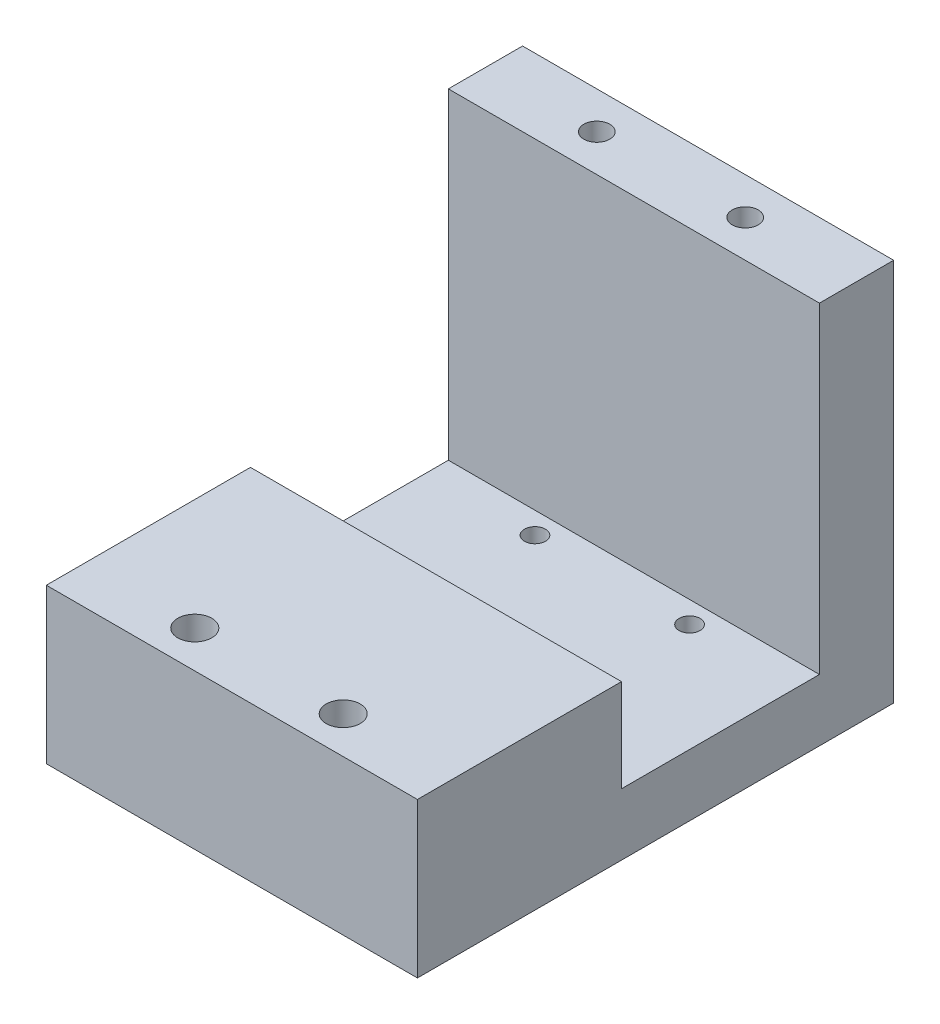
ISO-10303-21;
HEADER;
FILE_DESCRIPTION(('STEP AP214'),'2;1');
FILE_NAME('part.step','',(''),(''),'','','');
FILE_SCHEMA(('AUTOMOTIVE_DESIGN { 1 0 10303 214 1 1 1 1 }'));
ENDSEC;
DATA;
#1=APPLICATION_CONTEXT('core data for automotive mechanical design processes');
#2=APPLICATION_PROTOCOL_DEFINITION('international standard','automotive_design',2000,#1);
#3=PRODUCT_CONTEXT('',#1,'mechanical');
#4=PRODUCT('Part','Part','',(#3));
#5=PRODUCT_RELATED_PRODUCT_CATEGORY('part','',(#4));
#6=PRODUCT_DEFINITION_FORMATION('','',#4);
#7=PRODUCT_DEFINITION_CONTEXT('part definition',#1,'design');
#8=PRODUCT_DEFINITION('design','',#6,#7);
#9=PRODUCT_DEFINITION_SHAPE('','',#8);
#10=(LENGTH_UNIT() NAMED_UNIT(*) SI_UNIT(.MILLI.,.METRE.));
#11=(NAMED_UNIT(*) PLANE_ANGLE_UNIT() SI_UNIT($,.RADIAN.));
#12=(NAMED_UNIT(*) SI_UNIT($,.STERADIAN.) SOLID_ANGLE_UNIT());
#13=UNCERTAINTY_MEASURE_WITH_UNIT(LENGTH_MEASURE(1.E-05),#10,'distance_accuracy_value','');
#14=(GEOMETRIC_REPRESENTATION_CONTEXT(3) GLOBAL_UNCERTAINTY_ASSIGNED_CONTEXT((#13)) GLOBAL_UNIT_ASSIGNED_CONTEXT((#10,
#11,#12)) REPRESENTATION_CONTEXT('',''));
#15=CARTESIAN_POINT('',(0.,0.,0.));
#16=DIRECTION('',(0.,0.,1.));
#17=DIRECTION('',(1.,0.,0.));
#18=AXIS2_PLACEMENT_3D('',#15,#16,#17);
#19=CARTESIAN_POINT('',(0.,10.,0.));
#20=DIRECTION('',(0.,-1.,0.));
#21=DIRECTION('',(0.,0.,-1.));
#22=AXIS2_PLACEMENT_3D('',#19,#20,#21);
#23=PLANE('',#22);
#24=CARTESIAN_POINT('',(42.5,10.,-61.5000000000001));
#25=DIRECTION('',(0.,-1.,0.));
#26=DIRECTION('',(0.,0.,-1.));
#27=AXIS2_PLACEMENT_3D('',#24,#25,#26);
#28=CIRCLE('',#27,1.69999999999999);
#29=CARTESIAN_POINT('',(42.5,10.,-63.2000000000001));
#30=VERTEX_POINT('',#29);
#31=EDGE_CURVE('E43',#30,#30,#28,.T.);
#32=ORIENTED_EDGE('',*,*,#31,.T.);
#33=EDGE_LOOP('',(#32));
#34=FACE_BOUND('',#33,.T.);
#35=CARTESIAN_POINT('',(17.5,10.,-61.5000000000001));
#36=DIRECTION('',(0.,-1.,0.));
#37=DIRECTION('',(0.,0.,-1.));
#38=AXIS2_PLACEMENT_3D('',#35,#36,#37);
#39=CIRCLE('',#38,1.69999999999999);
#40=CARTESIAN_POINT('',(17.5,10.,-63.2000000000001));
#41=VERTEX_POINT('',#40);
#42=EDGE_CURVE('E192',#41,#41,#39,.T.);
#43=ORIENTED_EDGE('',*,*,#42,.T.);
#44=EDGE_LOOP('',(#43));
#45=FACE_BOUND('',#44,.T.);
#46=CARTESIAN_POINT('',(17.4999999999997,10.,-36.5000000000002));
#47=DIRECTION('',(0.,-1.,0.));
#48=DIRECTION('',(0.,0.,-1.));
#49=AXIS2_PLACEMENT_3D('',#46,#47,#48);
#50=CIRCLE('',#49,1.69999999999999);
#51=CARTESIAN_POINT('',(17.4999999999997,10.,-38.2000000000002));
#52=VERTEX_POINT('',#51);
#53=EDGE_CURVE('E188',#52,#52,#50,.T.);
#54=ORIENTED_EDGE('',*,*,#53,.T.);
#55=EDGE_LOOP('',(#54));
#56=FACE_BOUND('',#55,.T.);
#57=CARTESIAN_POINT('',(42.4999999999997,10.,-36.5000000000002));
#58=DIRECTION('',(0.,-1.,0.));
#59=DIRECTION('',(0.,0.,-1.));
#60=AXIS2_PLACEMENT_3D('',#57,#58,#59);
#61=CIRCLE('',#60,1.69999999999999);
#62=CARTESIAN_POINT('',(42.4999999999997,10.,-38.2000000000002));
#63=VERTEX_POINT('',#62);
#64=EDGE_CURVE('E183',#63,#63,#61,.T.);
#65=ORIENTED_EDGE('',*,*,#64,.T.);
#66=EDGE_LOOP('',(#65));
#67=FACE_BOUND('',#66,.T.);
#68=DIRECTION('',(-1.,0.,0.));
#69=VECTOR('',#68,1.);
#70=CARTESIAN_POINT('',(0.,10.,-33.));
#71=LINE('',#70,#69);
#72=CARTESIAN_POINT('',(60.,10.,-33.));
#73=VERTEX_POINT('',#72);
#74=CARTESIAN_POINT('',(0.,10.,-33.));
#75=VERTEX_POINT('',#74);
#76=EDGE_CURVE('E125',#73,#75,#71,.T.);
#77=ORIENTED_EDGE('',*,*,#76,.F.);
#78=DIRECTION('',(0.,0.,-1.));
#79=VECTOR('',#78,1.);
#80=CARTESIAN_POINT('',(60.,10.,0.));
#81=LINE('',#80,#79);
#82=CARTESIAN_POINT('',(60.,10.,-65.));
#83=VERTEX_POINT('',#82);
#84=EDGE_CURVE('E158',#73,#83,#81,.T.);
#85=ORIENTED_EDGE('',*,*,#84,.T.);
#86=DIRECTION('',(1.,0.,0.));
#87=VECTOR('',#86,1.);
#88=CARTESIAN_POINT('',(0.,10.,-65.));
#89=LINE('',#88,#87);
#90=CARTESIAN_POINT('',(0.,10.,-65.));
#91=VERTEX_POINT('',#90);
#92=EDGE_CURVE('E61',#91,#83,#89,.T.);
#93=ORIENTED_EDGE('',*,*,#92,.F.);
#94=DIRECTION('',(0.,0.,1.));
#95=VECTOR('',#94,1.);
#96=CARTESIAN_POINT('',(0.,10.,0.));
#97=LINE('',#96,#95);
#98=EDGE_CURVE('E56',#91,#75,#97,.T.);
#99=ORIENTED_EDGE('',*,*,#98,.T.);
#100=EDGE_LOOP('',(#77,#85,#93,#99));
#101=FACE_BOUND('',#100,.T.);
#102=ADVANCED_FACE('F39',(#34,#45,#56,#67,#101),#23,.F.);
#103=CARTESIAN_POINT('',(0.,10.,0.));
#104=DIRECTION('',(1.,0.,0.));
#105=DIRECTION('',(0.,0.,-1.));
#106=AXIS2_PLACEMENT_3D('',#103,#104,#105);
#107=PLANE('',#106);
#108=DIRECTION('',(0.,0.,1.));
#109=VECTOR('',#108,1.);
#110=CARTESIAN_POINT('',(0.,0.,0.));
#111=LINE('',#110,#109);
#112=CARTESIAN_POINT('',(0.,0.,-77.));
#113=VERTEX_POINT('',#112);
#114=CARTESIAN_POINT('',(0.,0.,0.));
#115=VERTEX_POINT('',#114);
#116=EDGE_CURVE('E111',#113,#115,#111,.T.);
#117=ORIENTED_EDGE('',*,*,#116,.T.);
#118=DIRECTION('',(0.,-1.,0.));
#119=VECTOR('',#118,1.);
#120=CARTESIAN_POINT('',(0.,10.,0.));
#121=LINE('',#120,#119);
#122=CARTESIAN_POINT('',(0.,25.,0.));
#123=VERTEX_POINT('',#122);
#124=EDGE_CURVE('E11',#123,#115,#121,.T.);
#125=ORIENTED_EDGE('',*,*,#124,.F.);
#126=DIRECTION('',(0.,0.,1.));
#127=VECTOR('',#126,1.);
#128=CARTESIAN_POINT('',(0.,25.,0.));
#129=LINE('',#128,#127);
#130=CARTESIAN_POINT('',(0.,25.,-33.));
#131=VERTEX_POINT('',#130);
#132=EDGE_CURVE('E108',#131,#123,#129,.T.);
#133=ORIENTED_EDGE('',*,*,#132,.F.);
#134=DIRECTION('',(0.,-1.,0.));
#135=VECTOR('',#134,1.);
#136=CARTESIAN_POINT('',(0.,25.,-33.));
#137=LINE('',#136,#135);
#138=EDGE_CURVE('E133',#131,#75,#137,.T.);
#139=ORIENTED_EDGE('',*,*,#138,.T.);
#140=ORIENTED_EDGE('',*,*,#98,.F.);
#141=DIRECTION('',(0.,-1.,0.));
#142=VECTOR('',#141,1.);
#143=CARTESIAN_POINT('',(0.,62.,-65.));
#144=LINE('',#143,#142);
#145=CARTESIAN_POINT('',(0.,62.,-65.));
#146=VERTEX_POINT('',#145);
#147=EDGE_CURVE('E154',#146,#91,#144,.T.);
#148=ORIENTED_EDGE('',*,*,#147,.F.);
#149=DIRECTION('',(0.,0.,1.));
#150=VECTOR('',#149,1.);
#151=CARTESIAN_POINT('',(0.,62.,-77.));
#152=LINE('',#151,#150);
#153=CARTESIAN_POINT('',(0.,62.,-77.));
#154=VERTEX_POINT('',#153);
#155=EDGE_CURVE('E139',#154,#146,#152,.T.);
#156=ORIENTED_EDGE('',*,*,#155,.F.);
#157=DIRECTION('',(0.,-1.,0.));
#158=VECTOR('',#157,1.);
#159=CARTESIAN_POINT('',(0.,10.,-77.));
#160=LINE('',#159,#158);
#161=EDGE_CURVE('E161',#154,#113,#160,.T.);
#162=ORIENTED_EDGE('',*,*,#161,.T.);
#163=EDGE_LOOP('',(#117,#125,#133,#139,#140,#148,#156,#162));
#164=FACE_BOUND('',#163,.T.);
#165=ADVANCED_FACE('F41',(#164),#107,.F.);
#166=CARTESIAN_POINT('',(0.,10.,0.));
#167=DIRECTION('',(0.,0.,-1.));
#168=DIRECTION('',(-1.,0.,0.));
#169=AXIS2_PLACEMENT_3D('',#166,#167,#168);
#170=PLANE('',#169);
#171=DIRECTION('',(1.,0.,0.));
#172=VECTOR('',#171,1.);
#173=CARTESIAN_POINT('',(0.,0.,0.));
#174=LINE('',#173,#172);
#175=CARTESIAN_POINT('',(60.,0.,0.));
#176=VERTEX_POINT('',#175);
#177=EDGE_CURVE('E163',#115,#176,#174,.T.);
#178=ORIENTED_EDGE('',*,*,#177,.T.);
#179=DIRECTION('',(0.,-1.,0.));
#180=VECTOR('',#179,1.);
#181=CARTESIAN_POINT('',(60.,10.,0.));
#182=LINE('',#181,#180);
#183=CARTESIAN_POINT('',(60.,25.,0.));
#184=VERTEX_POINT('',#183);
#185=EDGE_CURVE('E48',#184,#176,#182,.T.);
#186=ORIENTED_EDGE('',*,*,#185,.F.);
#187=DIRECTION('',(1.,0.,0.));
#188=VECTOR('',#187,1.);
#189=CARTESIAN_POINT('',(0.,25.,0.));
#190=LINE('',#189,#188);
#191=EDGE_CURVE('E114',#123,#184,#190,.T.);
#192=ORIENTED_EDGE('',*,*,#191,.F.);
#193=ORIENTED_EDGE('',*,*,#124,.T.);
#194=EDGE_LOOP('',(#178,#186,#192,#193));
#195=FACE_BOUND('',#194,.T.);
#196=ADVANCED_FACE('F115',(#195),#170,.F.);
#197=CARTESIAN_POINT('',(60.,10.,0.));
#198=DIRECTION('',(-1.,0.,0.));
#199=DIRECTION('',(0.,0.,1.));
#200=AXIS2_PLACEMENT_3D('',#197,#198,#199);
#201=PLANE('',#200);
#202=DIRECTION('',(0.,0.,-1.));
#203=VECTOR('',#202,1.);
#204=CARTESIAN_POINT('',(60.,0.,0.));
#205=LINE('',#204,#203);
#206=CARTESIAN_POINT('',(60.,0.,-77.));
#207=VERTEX_POINT('',#206);
#208=EDGE_CURVE('E165',#176,#207,#205,.T.);
#209=ORIENTED_EDGE('',*,*,#208,.T.);
#210=DIRECTION('',(0.,-1.,0.));
#211=VECTOR('',#210,1.);
#212=CARTESIAN_POINT('',(60.,10.,-77.));
#213=LINE('',#212,#211);
#214=CARTESIAN_POINT('',(60.,62.,-77.));
#215=VERTEX_POINT('',#214);
#216=EDGE_CURVE('E169',#215,#207,#213,.T.);
#217=ORIENTED_EDGE('',*,*,#216,.F.);
#218=DIRECTION('',(0.,0.,-1.));
#219=VECTOR('',#218,1.);
#220=CARTESIAN_POINT('',(60.,62.,-77.));
#221=LINE('',#220,#219);
#222=CARTESIAN_POINT('',(60.,62.,-65.));
#223=VERTEX_POINT('',#222);
#224=EDGE_CURVE('E144',#223,#215,#221,.T.);
#225=ORIENTED_EDGE('',*,*,#224,.F.);
#226=DIRECTION('',(0.,-1.,0.));
#227=VECTOR('',#226,1.);
#228=CARTESIAN_POINT('',(60.,62.,-65.));
#229=LINE('',#228,#227);
#230=EDGE_CURVE('E150',#223,#83,#229,.T.);
#231=ORIENTED_EDGE('',*,*,#230,.T.);
#232=ORIENTED_EDGE('',*,*,#84,.F.);
#233=DIRECTION('',(0.,-1.,0.));
#234=VECTOR('',#233,1.);
#235=CARTESIAN_POINT('',(60.,25.,-33.));
#236=LINE('',#235,#234);
#237=CARTESIAN_POINT('',(60.,25.,-33.));
#238=VERTEX_POINT('',#237);
#239=EDGE_CURVE('E136',#238,#73,#236,.T.);
#240=ORIENTED_EDGE('',*,*,#239,.F.);
#241=DIRECTION('',(0.,0.,-1.));
#242=VECTOR('',#241,1.);
#243=CARTESIAN_POINT('',(60.,25.,0.));
#244=LINE('',#243,#242);
#245=EDGE_CURVE('E119',#184,#238,#244,.T.);
#246=ORIENTED_EDGE('',*,*,#245,.F.);
#247=ORIENTED_EDGE('',*,*,#185,.T.);
#248=EDGE_LOOP('',(#209,#217,#225,#231,#232,#240,#246,#247));
#249=FACE_BOUND('',#248,.T.);
#250=ADVANCED_FACE('F283',(#249),#201,.F.);
#251=CARTESIAN_POINT('',(0.,10.,-77.));
#252=DIRECTION('',(0.,0.,1.));
#253=DIRECTION('',(1.,0.,0.));
#254=AXIS2_PLACEMENT_3D('',#251,#252,#253);
#255=PLANE('',#254);
#256=DIRECTION('',(-1.,0.,0.));
#257=VECTOR('',#256,1.);
#258=CARTESIAN_POINT('',(0.,0.,-77.));
#259=LINE('',#258,#257);
#260=EDGE_CURVE('E159',#207,#113,#259,.T.);
#261=ORIENTED_EDGE('',*,*,#260,.T.);
#262=ORIENTED_EDGE('',*,*,#161,.F.);
#263=DIRECTION('',(-1.,0.,0.));
#264=VECTOR('',#263,1.);
#265=CARTESIAN_POINT('',(0.,62.,-77.));
#266=LINE('',#265,#264);
#267=EDGE_CURVE('E147',#215,#154,#266,.T.);
#268=ORIENTED_EDGE('',*,*,#267,.F.);
#269=ORIENTED_EDGE('',*,*,#216,.T.);
#270=EDGE_LOOP('',(#261,#262,#268,#269));
#271=FACE_BOUND('',#270,.T.);
#272=ADVANCED_FACE('F279',(#271),#255,.F.);
#273=CARTESIAN_POINT('',(0.,0.,0.));
#274=DIRECTION('',(0.,-1.,0.));
#275=DIRECTION('',(0.,0.,-1.));
#276=AXIS2_PLACEMENT_3D('',#273,#274,#275);
#277=PLANE('',#276);
#278=CARTESIAN_POINT('',(42.5,0.,-61.5000000000001));
#279=DIRECTION('',(0.,-1.,0.));
#280=DIRECTION('',(0.,0.,-1.));
#281=AXIS2_PLACEMENT_3D('',#278,#279,#280);
#282=CIRCLE('',#281,3.25);
#283=CARTESIAN_POINT('',(42.5,0.,-64.7500000000001));
#284=VERTEX_POINT('',#283);
#285=EDGE_CURVE('E529',#284,#284,#282,.T.);
#286=ORIENTED_EDGE('',*,*,#285,.F.);
#287=EDGE_LOOP('',(#286));
#288=FACE_BOUND('',#287,.T.);
#289=CARTESIAN_POINT('',(17.5,0.,-61.5000000000001));
#290=DIRECTION('',(0.,-1.,0.));
#291=DIRECTION('',(0.,0.,-1.));
#292=AXIS2_PLACEMENT_3D('',#289,#290,#291);
#293=CIRCLE('',#292,3.25);
#294=CARTESIAN_POINT('',(17.5,0.,-64.7500000000002));
#295=VERTEX_POINT('',#294);
#296=EDGE_CURVE('E207',#295,#295,#293,.T.);
#297=ORIENTED_EDGE('',*,*,#296,.F.);
#298=EDGE_LOOP('',(#297));
#299=FACE_BOUND('',#298,.T.);
#300=CARTESIAN_POINT('',(17.4999999999997,0.,-36.5000000000002));
#301=DIRECTION('',(0.,-1.,0.));
#302=DIRECTION('',(0.,0.,-1.));
#303=AXIS2_PLACEMENT_3D('',#300,#301,#302);
#304=CIRCLE('',#303,3.25);
#305=CARTESIAN_POINT('',(17.4999999999997,0.,-39.7500000000002));
#306=VERTEX_POINT('',#305);
#307=EDGE_CURVE('E194',#306,#306,#304,.T.);
#308=ORIENTED_EDGE('',*,*,#307,.F.);
#309=EDGE_LOOP('',(#308));
#310=FACE_BOUND('',#309,.T.);
#311=CARTESIAN_POINT('',(42.4999999999997,0.,-36.5000000000002));
#312=DIRECTION('',(0.,-1.,0.));
#313=DIRECTION('',(0.,0.,-1.));
#314=AXIS2_PLACEMENT_3D('',#311,#312,#313);
#315=CIRCLE('',#314,3.25);
#316=CARTESIAN_POINT('',(42.4999999999997,0.,-39.7500000000002));
#317=VERTEX_POINT('',#316);
#318=EDGE_CURVE('E190',#317,#317,#315,.T.);
#319=ORIENTED_EDGE('',*,*,#318,.F.);
#320=EDGE_LOOP('',(#319));
#321=FACE_BOUND('',#320,.T.);
#322=CARTESIAN_POINT('',(41.9999999999999,0.,-6.00000000000021));
#323=DIRECTION('',(0.,-1.,0.));
#324=DIRECTION('',(0.,0.,-1.));
#325=AXIS2_PLACEMENT_3D('',#322,#323,#324);
#326=CIRCLE('',#325,5.);
#327=CARTESIAN_POINT('',(41.9999999999999,0.,-11.0000000000002));
#328=VERTEX_POINT('',#327);
#329=EDGE_CURVE('E186',#328,#328,#326,.T.);
#330=ORIENTED_EDGE('',*,*,#329,.F.);
#331=EDGE_LOOP('',(#330));
#332=FACE_BOUND('',#331,.T.);
#333=CARTESIAN_POINT('',(17.9999999999999,0.,-6.00000000000021));
#334=DIRECTION('',(0.,-1.,0.));
#335=DIRECTION('',(0.,0.,-1.));
#336=AXIS2_PLACEMENT_3D('',#333,#334,#335);
#337=CIRCLE('',#336,5.);
#338=CARTESIAN_POINT('',(17.9999999999999,0.,-11.0000000000002));
#339=VERTEX_POINT('',#338);
#340=EDGE_CURVE('E181',#339,#339,#337,.T.);
#341=ORIENTED_EDGE('',*,*,#340,.F.);
#342=EDGE_LOOP('',(#341));
#343=FACE_BOUND('',#342,.T.);
#344=CARTESIAN_POINT('',(17.9999999999999,0.,-71.0000000000002));
#345=DIRECTION('',(0.,1.,0.));
#346=DIRECTION('',(0.,0.,1.));
#347=AXIS2_PLACEMENT_3D('',#344,#345,#346);
#348=CIRCLE('',#347,2.09999999999999);
#349=CARTESIAN_POINT('',(17.9999999999999,0.,-68.9000000000002));
#350=VERTEX_POINT('',#349);
#351=EDGE_CURVE('E238',#350,#350,#348,.T.);
#352=ORIENTED_EDGE('',*,*,#351,.T.);
#353=EDGE_LOOP('',(#352));
#354=FACE_BOUND('',#353,.T.);
#355=CARTESIAN_POINT('',(41.9999999999999,0.,-71.0000000000002));
#356=DIRECTION('',(0.,1.,0.));
#357=DIRECTION('',(0.,0.,1.));
#358=AXIS2_PLACEMENT_3D('',#355,#356,#357);
#359=CIRCLE('',#358,2.09999999999999);
#360=CARTESIAN_POINT('',(41.9999999999999,0.,-68.9000000000002));
#361=VERTEX_POINT('',#360);
#362=EDGE_CURVE('E127',#361,#361,#359,.T.);
#363=ORIENTED_EDGE('',*,*,#362,.T.);
#364=EDGE_LOOP('',(#363));
#365=FACE_BOUND('',#364,.T.);
#366=ORIENTED_EDGE('',*,*,#116,.F.);
#367=ORIENTED_EDGE('',*,*,#260,.F.);
#368=ORIENTED_EDGE('',*,*,#208,.F.);
#369=ORIENTED_EDGE('',*,*,#177,.F.);
#370=EDGE_LOOP('',(#366,#367,#368,#369));
#371=FACE_BOUND('',#370,.T.);
#372=ADVANCED_FACE('F247',(#288,#299,#310,#321,#332,#343,#354,#365,#371),#277,.T.);
#373=CARTESIAN_POINT('',(0.,62.,-65.));
#374=DIRECTION('',(0.,0.,-1.));
#375=DIRECTION('',(-1.,0.,0.));
#376=AXIS2_PLACEMENT_3D('',#373,#374,#375);
#377=PLANE('',#376);
#378=ORIENTED_EDGE('',*,*,#92,.T.);
#379=ORIENTED_EDGE('',*,*,#230,.F.);
#380=DIRECTION('',(1.,0.,0.));
#381=VECTOR('',#380,1.);
#382=CARTESIAN_POINT('',(0.,62.,-65.));
#383=LINE('',#382,#381);
#384=EDGE_CURVE('E142',#146,#223,#383,.T.);
#385=ORIENTED_EDGE('',*,*,#384,.F.);
#386=ORIENTED_EDGE('',*,*,#147,.T.);
#387=EDGE_LOOP('',(#378,#379,#385,#386));
#388=FACE_BOUND('',#387,.T.);
#389=ADVANCED_FACE('F276',(#388),#377,.F.);
#390=CARTESIAN_POINT('',(0.,62.,0.));
#391=DIRECTION('',(0.,1.,0.));
#392=DIRECTION('',(0.,0.,1.));
#393=AXIS2_PLACEMENT_3D('',#390,#391,#392);
#394=PLANE('',#393);
#395=CARTESIAN_POINT('',(17.9999999999999,62.,-71.0000000000002));
#396=DIRECTION('',(0.,1.,0.));
#397=DIRECTION('',(0.,0.,1.));
#398=AXIS2_PLACEMENT_3D('',#395,#396,#397);
#399=CIRCLE('',#398,2.1);
#400=CARTESIAN_POINT('',(17.9999999999999,62.,-68.9000000000002));
#401=VERTEX_POINT('',#400);
#402=EDGE_CURVE('E176',#401,#401,#399,.T.);
#403=ORIENTED_EDGE('',*,*,#402,.F.);
#404=EDGE_LOOP('',(#403));
#405=FACE_BOUND('',#404,.T.);
#406=CARTESIAN_POINT('',(41.9999999999999,62.,-71.0000000000002));
#407=DIRECTION('',(0.,1.,0.));
#408=DIRECTION('',(0.,0.,1.));
#409=AXIS2_PLACEMENT_3D('',#406,#407,#408);
#410=CIRCLE('',#409,2.1);
#411=CARTESIAN_POINT('',(41.9999999999999,62.,-68.9000000000002));
#412=VERTEX_POINT('',#411);
#413=EDGE_CURVE('E240',#412,#412,#410,.T.);
#414=ORIENTED_EDGE('',*,*,#413,.F.);
#415=EDGE_LOOP('',(#414));
#416=FACE_BOUND('',#415,.T.);
#417=ORIENTED_EDGE('',*,*,#155,.T.);
#418=ORIENTED_EDGE('',*,*,#384,.T.);
#419=ORIENTED_EDGE('',*,*,#224,.T.);
#420=ORIENTED_EDGE('',*,*,#267,.T.);
#421=EDGE_LOOP('',(#417,#418,#419,#420));
#422=FACE_BOUND('',#421,.T.);
#423=ADVANCED_FACE('F316',(#405,#416,#422),#394,.T.);
#424=CARTESIAN_POINT('',(0.,25.,-33.));
#425=DIRECTION('',(0.,0.,1.));
#426=DIRECTION('',(1.,0.,0.));
#427=AXIS2_PLACEMENT_3D('',#424,#425,#426);
#428=PLANE('',#427);
#429=ORIENTED_EDGE('',*,*,#76,.T.);
#430=ORIENTED_EDGE('',*,*,#138,.F.);
#431=DIRECTION('',(-1.,0.,0.));
#432=VECTOR('',#431,1.);
#433=CARTESIAN_POINT('',(0.,25.,-33.));
#434=LINE('',#433,#432);
#435=EDGE_CURVE('E123',#238,#131,#434,.T.);
#436=ORIENTED_EDGE('',*,*,#435,.F.);
#437=ORIENTED_EDGE('',*,*,#239,.T.);
#438=EDGE_LOOP('',(#429,#430,#436,#437));
#439=FACE_BOUND('',#438,.T.);
#440=ADVANCED_FACE('F262',(#439),#428,.F.);
#441=CARTESIAN_POINT('',(0.,25.,0.));
#442=DIRECTION('',(0.,-1.,0.));
#443=DIRECTION('',(0.,0.,-1.));
#444=AXIS2_PLACEMENT_3D('',#441,#442,#443);
#445=PLANE('',#444);
#446=CARTESIAN_POINT('',(41.9999999999999,25.,-6.00000000000021));
#447=DIRECTION('',(0.,-1.,0.));
#448=DIRECTION('',(0.,0.,-1.));
#449=AXIS2_PLACEMENT_3D('',#446,#447,#448);
#450=CIRCLE('',#449,2.74999999999999);
#451=CARTESIAN_POINT('',(41.9999999999999,25.,-8.7500000000002));
#452=VERTEX_POINT('',#451);
#453=EDGE_CURVE('E178',#452,#452,#450,.T.);
#454=ORIENTED_EDGE('',*,*,#453,.T.);
#455=EDGE_LOOP('',(#454));
#456=FACE_BOUND('',#455,.T.);
#457=CARTESIAN_POINT('',(17.9999999999999,25.,-6.00000000000021));
#458=DIRECTION('',(0.,-1.,0.));
#459=DIRECTION('',(0.,0.,-1.));
#460=AXIS2_PLACEMENT_3D('',#457,#458,#459);
#461=CIRCLE('',#460,2.74999999999999);
#462=CARTESIAN_POINT('',(17.9999999999999,25.,-8.7500000000002));
#463=VERTEX_POINT('',#462);
#464=EDGE_CURVE('E173',#463,#463,#461,.T.);
#465=ORIENTED_EDGE('',*,*,#464,.T.);
#466=EDGE_LOOP('',(#465));
#467=FACE_BOUND('',#466,.T.);
#468=ORIENTED_EDGE('',*,*,#132,.T.);
#469=ORIENTED_EDGE('',*,*,#191,.T.);
#470=ORIENTED_EDGE('',*,*,#245,.T.);
#471=ORIENTED_EDGE('',*,*,#435,.T.);
#472=EDGE_LOOP('',(#468,#469,#470,#471));
#473=FACE_BOUND('',#472,.T.);
#474=ADVANCED_FACE('F121',(#456,#467,#473),#445,.F.);
#475=CARTESIAN_POINT('',(41.9999999999999,62.,-71.0000000000002));
#476=DIRECTION('',(0.,1.,0.));
#477=DIRECTION('',(0.,0.,1.));
#478=AXIS2_PLACEMENT_3D('',#475,#476,#477);
#479=CYLINDRICAL_SURFACE('',#478,2.09999999999999);
#480=ORIENTED_EDGE('',*,*,#362,.F.);
#481=EDGE_LOOP('',(#480));
#482=FACE_BOUND('',#481,.T.);
#483=ORIENTED_EDGE('',*,*,#413,.T.);
#484=EDGE_LOOP('',(#483));
#485=FACE_BOUND('',#484,.T.);
#486=ADVANCED_FACE('F250',(#482,#485),#479,.F.);
#487=CARTESIAN_POINT('',(17.9999999999999,62.,-71.0000000000002));
#488=DIRECTION('',(0.,1.,0.));
#489=DIRECTION('',(0.,0.,1.));
#490=AXIS2_PLACEMENT_3D('',#487,#488,#489);
#491=CYLINDRICAL_SURFACE('',#490,2.09999999999999);
#492=ORIENTED_EDGE('',*,*,#351,.F.);
#493=EDGE_LOOP('',(#492));
#494=FACE_BOUND('',#493,.T.);
#495=ORIENTED_EDGE('',*,*,#402,.T.);
#496=EDGE_LOOP('',(#495));
#497=FACE_BOUND('',#496,.T.);
#498=ADVANCED_FACE('F252',(#494,#497),#491,.F.);
#499=CARTESIAN_POINT('',(17.9999999999999,0.,-6.00000000000021));
#500=DIRECTION('',(0.,-1.,0.));
#501=DIRECTION('',(0.,0.,-1.));
#502=AXIS2_PLACEMENT_3D('',#499,#500,#501);
#503=CYLINDRICAL_SURFACE('',#502,2.74999999999999);
#504=CARTESIAN_POINT('',(17.9999999999999,20.,-6.00000000000021));
#505=DIRECTION('',(0.,-1.,0.));
#506=DIRECTION('',(0.,0.,-1.));
#507=AXIS2_PLACEMENT_3D('',#504,#505,#506);
#508=CIRCLE('',#507,2.75);
#509=CARTESIAN_POINT('',(17.9999999999999,20.,-8.75000000000021));
#510=VERTEX_POINT('',#509);
#511=EDGE_CURVE('E177',#510,#510,#508,.T.);
#512=ORIENTED_EDGE('',*,*,#511,.T.);
#513=EDGE_LOOP('',(#512));
#514=FACE_BOUND('',#513,.T.);
#515=ORIENTED_EDGE('',*,*,#464,.F.);
#516=EDGE_LOOP('',(#515));
#517=FACE_BOUND('',#516,.T.);
#518=ADVANCED_FACE('F258',(#514,#517),#503,.F.);
#519=CARTESIAN_POINT('',(20.7499999999999,20.,-6.00000000000021));
#520=DIRECTION('',(0.,1.,0.));
#521=DIRECTION('',(0.,0.,1.));
#522=AXIS2_PLACEMENT_3D('',#519,#520,#521);
#523=PLANE('',#522);
#524=ORIENTED_EDGE('',*,*,#511,.F.);
#525=EDGE_LOOP('',(#524));
#526=FACE_BOUND('',#525,.T.);
#527=CARTESIAN_POINT('',(17.9999999999999,20.,-6.00000000000021));
#528=DIRECTION('',(0.,-1.,0.));
#529=DIRECTION('',(0.,0.,-1.));
#530=AXIS2_PLACEMENT_3D('',#527,#528,#529);
#531=CIRCLE('',#530,4.99999999999999);
#532=CARTESIAN_POINT('',(17.9999999999999,20.,-11.0000000000002));
#533=VERTEX_POINT('',#532);
#534=EDGE_CURVE('E231',#533,#533,#531,.T.);
#535=ORIENTED_EDGE('',*,*,#534,.T.);
#536=EDGE_LOOP('',(#535));
#537=FACE_BOUND('',#536,.T.);
#538=ADVANCED_FACE('F352',(#526,#537),#523,.F.);
#539=CARTESIAN_POINT('',(17.9999999999999,0.,-6.00000000000021));
#540=DIRECTION('',(0.,-1.,0.));
#541=DIRECTION('',(0.,0.,-1.));
#542=AXIS2_PLACEMENT_3D('',#539,#540,#541);
#543=CYLINDRICAL_SURFACE('',#542,5.);
#544=ORIENTED_EDGE('',*,*,#534,.F.);
#545=EDGE_LOOP('',(#544));
#546=FACE_BOUND('',#545,.T.);
#547=ORIENTED_EDGE('',*,*,#340,.T.);
#548=EDGE_LOOP('',(#547));
#549=FACE_BOUND('',#548,.T.);
#550=ADVANCED_FACE('F362',(#546,#549),#543,.F.);
#551=CARTESIAN_POINT('',(41.9999999999999,0.,-6.00000000000021));
#552=DIRECTION('',(0.,-1.,0.));
#553=DIRECTION('',(0.,0.,-1.));
#554=AXIS2_PLACEMENT_3D('',#551,#552,#553);
#555=CYLINDRICAL_SURFACE('',#554,2.74999999999999);
#556=CARTESIAN_POINT('',(41.9999999999999,20.,-6.00000000000021));
#557=DIRECTION('',(0.,-1.,0.));
#558=DIRECTION('',(0.,0.,-1.));
#559=AXIS2_PLACEMENT_3D('',#556,#557,#558);
#560=CIRCLE('',#559,2.75);
#561=CARTESIAN_POINT('',(41.9999999999999,20.,-8.75000000000021));
#562=VERTEX_POINT('',#561);
#563=EDGE_CURVE('E182',#562,#562,#560,.T.);
#564=ORIENTED_EDGE('',*,*,#563,.T.);
#565=EDGE_LOOP('',(#564));
#566=FACE_BOUND('',#565,.T.);
#567=ORIENTED_EDGE('',*,*,#453,.F.);
#568=EDGE_LOOP('',(#567));
#569=FACE_BOUND('',#568,.T.);
#570=ADVANCED_FACE('F372',(#566,#569),#555,.F.);
#571=CARTESIAN_POINT('',(44.7499999999999,20.,-6.00000000000021));
#572=DIRECTION('',(0.,1.,0.));
#573=DIRECTION('',(0.,0.,1.));
#574=AXIS2_PLACEMENT_3D('',#571,#572,#573);
#575=PLANE('',#574);
#576=ORIENTED_EDGE('',*,*,#563,.F.);
#577=EDGE_LOOP('',(#576));
#578=FACE_BOUND('',#577,.T.);
#579=CARTESIAN_POINT('',(41.9999999999999,20.,-6.00000000000021));
#580=DIRECTION('',(0.,-1.,0.));
#581=DIRECTION('',(0.,0.,-1.));
#582=AXIS2_PLACEMENT_3D('',#579,#580,#581);
#583=CIRCLE('',#582,5.);
#584=CARTESIAN_POINT('',(41.9999999999999,20.,-11.0000000000002));
#585=VERTEX_POINT('',#584);
#586=EDGE_CURVE('E224',#585,#585,#583,.T.);
#587=ORIENTED_EDGE('',*,*,#586,.T.);
#588=EDGE_LOOP('',(#587));
#589=FACE_BOUND('',#588,.T.);
#590=ADVANCED_FACE('F382',(#578,#589),#575,.F.);
#591=CARTESIAN_POINT('',(41.9999999999999,0.,-6.00000000000021));
#592=DIRECTION('',(0.,-1.,0.));
#593=DIRECTION('',(0.,0.,-1.));
#594=AXIS2_PLACEMENT_3D('',#591,#592,#593);
#595=CYLINDRICAL_SURFACE('',#594,5.);
#596=ORIENTED_EDGE('',*,*,#586,.F.);
#597=EDGE_LOOP('',(#596));
#598=FACE_BOUND('',#597,.T.);
#599=ORIENTED_EDGE('',*,*,#329,.T.);
#600=EDGE_LOOP('',(#599));
#601=FACE_BOUND('',#600,.T.);
#602=ADVANCED_FACE('F391',(#598,#601),#595,.F.);
#603=CARTESIAN_POINT('',(42.4999999999997,0.,-36.5000000000002));
#604=DIRECTION('',(0.,-1.,0.));
#605=DIRECTION('',(0.,0.,-1.));
#606=AXIS2_PLACEMENT_3D('',#603,#604,#605);
#607=CYLINDRICAL_SURFACE('',#606,1.69999999999999);
#608=CARTESIAN_POINT('',(42.4999999999997,3.,-36.5000000000002));
#609=DIRECTION('',(0.,-1.,0.));
#610=DIRECTION('',(0.,0.,-1.));
#611=AXIS2_PLACEMENT_3D('',#608,#609,#610);
#612=CIRCLE('',#611,1.7);
#613=CARTESIAN_POINT('',(42.4999999999997,3.,-38.2000000000002));
#614=VERTEX_POINT('',#613);
#615=EDGE_CURVE('E187',#614,#614,#612,.T.);
#616=ORIENTED_EDGE('',*,*,#615,.T.);
#617=EDGE_LOOP('',(#616));
#618=FACE_BOUND('',#617,.T.);
#619=ORIENTED_EDGE('',*,*,#64,.F.);
#620=EDGE_LOOP('',(#619));
#621=FACE_BOUND('',#620,.T.);
#622=ADVANCED_FACE('F400',(#618,#621),#607,.F.);
#623=CARTESIAN_POINT('',(44.1999999999997,3.,-36.5000000000002));
#624=DIRECTION('',(0.,1.,0.));
#625=DIRECTION('',(0.,0.,1.));
#626=AXIS2_PLACEMENT_3D('',#623,#624,#625);
#627=PLANE('',#626);
#628=ORIENTED_EDGE('',*,*,#615,.F.);
#629=EDGE_LOOP('',(#628));
#630=FACE_BOUND('',#629,.T.);
#631=CARTESIAN_POINT('',(42.4999999999997,3.,-36.5000000000002));
#632=DIRECTION('',(0.,-1.,0.));
#633=DIRECTION('',(0.,0.,-1.));
#634=AXIS2_PLACEMENT_3D('',#631,#632,#633);
#635=CIRCLE('',#634,3.25);
#636=CARTESIAN_POINT('',(42.4999999999997,3.,-39.7500000000002));
#637=VERTEX_POINT('',#636);
#638=EDGE_CURVE('E217',#637,#637,#635,.T.);
#639=ORIENTED_EDGE('',*,*,#638,.T.);
#640=EDGE_LOOP('',(#639));
#641=FACE_BOUND('',#640,.T.);
#642=ADVANCED_FACE('F410',(#630,#641),#627,.F.);
#643=CARTESIAN_POINT('',(42.4999999999997,0.,-36.5000000000002));
#644=DIRECTION('',(0.,-1.,0.));
#645=DIRECTION('',(0.,0.,-1.));
#646=AXIS2_PLACEMENT_3D('',#643,#644,#645);
#647=CYLINDRICAL_SURFACE('',#646,3.25);
#648=ORIENTED_EDGE('',*,*,#638,.F.);
#649=EDGE_LOOP('',(#648));
#650=FACE_BOUND('',#649,.T.);
#651=ORIENTED_EDGE('',*,*,#318,.T.);
#652=EDGE_LOOP('',(#651));
#653=FACE_BOUND('',#652,.T.);
#654=ADVANCED_FACE('F417',(#650,#653),#647,.F.);
#655=CARTESIAN_POINT('',(17.4999999999997,0.,-36.5000000000002));
#656=DIRECTION('',(0.,-1.,0.));
#657=DIRECTION('',(0.,0.,-1.));
#658=AXIS2_PLACEMENT_3D('',#655,#656,#657);
#659=CYLINDRICAL_SURFACE('',#658,1.69999999999999);
#660=CARTESIAN_POINT('',(17.4999999999997,3.,-36.5000000000002));
#661=DIRECTION('',(0.,-1.,0.));
#662=DIRECTION('',(0.,0.,-1.));
#663=AXIS2_PLACEMENT_3D('',#660,#661,#662);
#664=CIRCLE('',#663,1.7);
#665=CARTESIAN_POINT('',(17.4999999999997,3.,-38.2000000000002));
#666=VERTEX_POINT('',#665);
#667=EDGE_CURVE('E191',#666,#666,#664,.T.);
#668=ORIENTED_EDGE('',*,*,#667,.T.);
#669=EDGE_LOOP('',(#668));
#670=FACE_BOUND('',#669,.T.);
#671=ORIENTED_EDGE('',*,*,#53,.F.);
#672=EDGE_LOOP('',(#671));
#673=FACE_BOUND('',#672,.T.);
#674=ADVANCED_FACE('F425',(#670,#673),#659,.F.);
#675=CARTESIAN_POINT('',(19.1999999999997,3.,-36.5000000000002));
#676=DIRECTION('',(0.,1.,0.));
#677=DIRECTION('',(0.,0.,1.));
#678=AXIS2_PLACEMENT_3D('',#675,#676,#677);
#679=PLANE('',#678);
#680=ORIENTED_EDGE('',*,*,#667,.F.);
#681=EDGE_LOOP('',(#680));
#682=FACE_BOUND('',#681,.T.);
#683=CARTESIAN_POINT('',(17.4999999999997,3.,-36.5000000000002));
#684=DIRECTION('',(0.,-1.,0.));
#685=DIRECTION('',(0.,0.,-1.));
#686=AXIS2_PLACEMENT_3D('',#683,#684,#685);
#687=CIRCLE('',#686,3.25);
#688=CARTESIAN_POINT('',(17.4999999999997,3.,-39.7500000000002));
#689=VERTEX_POINT('',#688);
#690=EDGE_CURVE('E199',#689,#689,#687,.T.);
#691=ORIENTED_EDGE('',*,*,#690,.T.);
#692=EDGE_LOOP('',(#691));
#693=FACE_BOUND('',#692,.T.);
#694=ADVANCED_FACE('F433',(#682,#693),#679,.F.);
#695=CARTESIAN_POINT('',(17.4999999999997,0.,-36.5000000000002));
#696=DIRECTION('',(0.,-1.,0.));
#697=DIRECTION('',(0.,0.,-1.));
#698=AXIS2_PLACEMENT_3D('',#695,#696,#697);
#699=CYLINDRICAL_SURFACE('',#698,3.25);
#700=ORIENTED_EDGE('',*,*,#690,.F.);
#701=EDGE_LOOP('',(#700));
#702=FACE_BOUND('',#701,.T.);
#703=ORIENTED_EDGE('',*,*,#307,.T.);
#704=EDGE_LOOP('',(#703));
#705=FACE_BOUND('',#704,.T.);
#706=ADVANCED_FACE('F441',(#702,#705),#699,.F.);
#707=CARTESIAN_POINT('',(17.5,0.,-61.5000000000001));
#708=DIRECTION('',(0.,-1.,0.));
#709=DIRECTION('',(0.,0.,-1.));
#710=AXIS2_PLACEMENT_3D('',#707,#708,#709);
#711=CYLINDRICAL_SURFACE('',#710,1.69999999999999);
#712=CARTESIAN_POINT('',(17.5,3.,-61.5000000000001));
#713=DIRECTION('',(0.,-1.,0.));
#714=DIRECTION('',(0.,0.,-1.));
#715=AXIS2_PLACEMENT_3D('',#712,#713,#714);
#716=CIRCLE('',#715,1.7);
#717=CARTESIAN_POINT('',(17.5,3.,-63.2000000000001));
#718=VERTEX_POINT('',#717);
#719=EDGE_CURVE('E195',#718,#718,#716,.T.);
#720=ORIENTED_EDGE('',*,*,#719,.T.);
#721=EDGE_LOOP('',(#720));
#722=FACE_BOUND('',#721,.T.);
#723=ORIENTED_EDGE('',*,*,#42,.F.);
#724=EDGE_LOOP('',(#723));
#725=FACE_BOUND('',#724,.T.);
#726=ADVANCED_FACE('F449',(#722,#725),#711,.F.);
#727=CARTESIAN_POINT('',(19.1999999999999,3.,-61.5000000000001));
#728=DIRECTION('',(0.,1.,0.));
#729=DIRECTION('',(0.,0.,1.));
#730=AXIS2_PLACEMENT_3D('',#727,#728,#729);
#731=PLANE('',#730);
#732=ORIENTED_EDGE('',*,*,#719,.F.);
#733=EDGE_LOOP('',(#732));
#734=FACE_BOUND('',#733,.T.);
#735=CARTESIAN_POINT('',(17.5,3.,-61.5000000000001));
#736=DIRECTION('',(0.,-1.,0.));
#737=DIRECTION('',(0.,0.,-1.));
#738=AXIS2_PLACEMENT_3D('',#735,#736,#737);
#739=CIRCLE('',#738,3.25);
#740=CARTESIAN_POINT('',(17.5,3.,-64.7500000000002));
#741=VERTEX_POINT('',#740);
#742=EDGE_CURVE('E202',#741,#741,#739,.T.);
#743=ORIENTED_EDGE('',*,*,#742,.T.);
#744=EDGE_LOOP('',(#743));
#745=FACE_BOUND('',#744,.T.);
#746=ADVANCED_FACE('F457',(#734,#745),#731,.F.);
#747=CARTESIAN_POINT('',(17.5,0.,-61.5000000000001));
#748=DIRECTION('',(0.,-1.,0.));
#749=DIRECTION('',(0.,0.,-1.));
#750=AXIS2_PLACEMENT_3D('',#747,#748,#749);
#751=CYLINDRICAL_SURFACE('',#750,3.25);
#752=ORIENTED_EDGE('',*,*,#742,.F.);
#753=EDGE_LOOP('',(#752));
#754=FACE_BOUND('',#753,.T.);
#755=ORIENTED_EDGE('',*,*,#296,.T.);
#756=EDGE_LOOP('',(#755));
#757=FACE_BOUND('',#756,.T.);
#758=ADVANCED_FACE('F464',(#754,#757),#751,.F.);
#759=CARTESIAN_POINT('',(42.5,0.,-61.5000000000001));
#760=DIRECTION('',(0.,-1.,0.));
#761=DIRECTION('',(0.,0.,-1.));
#762=AXIS2_PLACEMENT_3D('',#759,#760,#761);
#763=CYLINDRICAL_SURFACE('',#762,1.69999999999999);
#764=CARTESIAN_POINT('',(42.5,3.,-61.5000000000001));
#765=DIRECTION('',(0.,-1.,0.));
#766=DIRECTION('',(0.,0.,-1.));
#767=AXIS2_PLACEMENT_3D('',#764,#765,#766);
#768=CIRCLE('',#767,1.7);
#769=CARTESIAN_POINT('',(42.5,3.,-63.2000000000001));
#770=VERTEX_POINT('',#769);
#771=EDGE_CURVE('E531',#770,#770,#768,.T.);
#772=ORIENTED_EDGE('',*,*,#771,.T.);
#773=EDGE_LOOP('',(#772));
#774=FACE_BOUND('',#773,.T.);
#775=ORIENTED_EDGE('',*,*,#31,.F.);
#776=EDGE_LOOP('',(#775));
#777=FACE_BOUND('',#776,.T.);
#778=ADVANCED_FACE('F472',(#774,#777),#763,.F.);
#779=CARTESIAN_POINT('',(44.1999999999999,3.,-61.5000000000001));
#780=DIRECTION('',(0.,1.,0.));
#781=DIRECTION('',(0.,0.,1.));
#782=AXIS2_PLACEMENT_3D('',#779,#780,#781);
#783=PLANE('',#782);
#784=ORIENTED_EDGE('',*,*,#771,.F.);
#785=EDGE_LOOP('',(#784));
#786=FACE_BOUND('',#785,.T.);
#787=CARTESIAN_POINT('',(42.5,3.,-61.5000000000001));
#788=DIRECTION('',(0.,-1.,0.));
#789=DIRECTION('',(0.,0.,-1.));
#790=AXIS2_PLACEMENT_3D('',#787,#788,#789);
#791=CIRCLE('',#790,3.25);
#792=CARTESIAN_POINT('',(42.5,3.,-64.7500000000001));
#793=VERTEX_POINT('',#792);
#794=EDGE_CURVE('E526',#793,#793,#791,.T.);
#795=ORIENTED_EDGE('',*,*,#794,.T.);
#796=EDGE_LOOP('',(#795));
#797=FACE_BOUND('',#796,.T.);
#798=ADVANCED_FACE('F480',(#786,#797),#783,.F.);
#799=CARTESIAN_POINT('',(42.5,0.,-61.5000000000001));
#800=DIRECTION('',(0.,-1.,0.));
#801=DIRECTION('',(0.,0.,-1.));
#802=AXIS2_PLACEMENT_3D('',#799,#800,#801);
#803=CYLINDRICAL_SURFACE('',#802,3.25);
#804=ORIENTED_EDGE('',*,*,#794,.F.);
#805=EDGE_LOOP('',(#804));
#806=FACE_BOUND('',#805,.T.);
#807=ORIENTED_EDGE('',*,*,#285,.T.);
#808=EDGE_LOOP('',(#807));
#809=FACE_BOUND('',#808,.T.);
#810=ADVANCED_FACE('F488',(#806,#809),#803,.F.);
#811=CLOSED_SHELL('',(#102,#165,#196,#250,#272,#372,#389,#423,#440,#474,#486,#498,#518,#538,
#550,#570,#590,#602,#622,#642,#654,#674,#694,#706,#726,#746,#758,#778,#798,#810));
#812=MANIFOLD_SOLID_BREP('B2',#811);
#813=ADVANCED_BREP_SHAPE_REPRESENTATION('',(#18,#812),#14);
#814=SHAPE_DEFINITION_REPRESENTATION(#9,#813);
ENDSEC;
END-ISO-10303-21;
